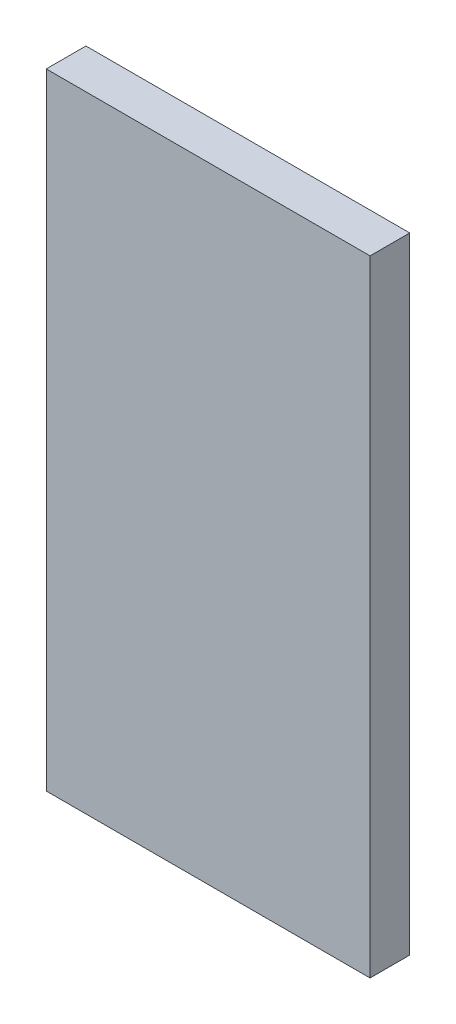
ISO-10303-21;
HEADER;
FILE_DESCRIPTION(('STEP AP214'),'2;1');
FILE_NAME('part.step','',(''),(''),'','','');
FILE_SCHEMA(('AUTOMOTIVE_DESIGN { 1 0 10303 214 1 1 1 1 }'));
ENDSEC;
DATA;
#1=APPLICATION_CONTEXT('core data for automotive mechanical design processes');
#2=APPLICATION_PROTOCOL_DEFINITION('international standard','automotive_design',2000,#1);
#3=PRODUCT_CONTEXT('',#1,'mechanical');
#4=PRODUCT('Part','Part','',(#3));
#5=PRODUCT_RELATED_PRODUCT_CATEGORY('part','',(#4));
#6=PRODUCT_DEFINITION_FORMATION('','',#4);
#7=PRODUCT_DEFINITION_CONTEXT('part definition',#1,'design');
#8=PRODUCT_DEFINITION('design','',#6,#7);
#9=PRODUCT_DEFINITION_SHAPE('','',#8);
#10=(LENGTH_UNIT() NAMED_UNIT(*) SI_UNIT(.MILLI.,.METRE.));
#11=(NAMED_UNIT(*) PLANE_ANGLE_UNIT() SI_UNIT($,.RADIAN.));
#12=(NAMED_UNIT(*) SI_UNIT($,.STERADIAN.) SOLID_ANGLE_UNIT());
#13=UNCERTAINTY_MEASURE_WITH_UNIT(LENGTH_MEASURE(1.E-05),#10,'distance_accuracy_value','');
#14=(GEOMETRIC_REPRESENTATION_CONTEXT(3) GLOBAL_UNCERTAINTY_ASSIGNED_CONTEXT((#13)) GLOBAL_UNIT_ASSIGNED_CONTEXT((#10,
#11,#12)) REPRESENTATION_CONTEXT('',''));
#15=CARTESIAN_POINT('',(0.,0.,0.));
#16=DIRECTION('',(0.,0.,1.));
#17=DIRECTION('',(1.,0.,0.));
#18=AXIS2_PLACEMENT_3D('',#15,#16,#17);
#19=CARTESIAN_POINT('',(4.672,-3.698,0.1));
#20=DIRECTION('',(0.,0.,1.));
#21=DIRECTION('',(1.,0.,0.));
#22=AXIS2_PLACEMENT_3D('',#19,#20,#21);
#23=PLANE('',#22);
#24=DIRECTION('',(0.,1.,0.));
#25=VECTOR('',#24,1.);
#26=CARTESIAN_POINT('',(5.488,-3.698,0.1));
#27=LINE('',#26,#25);
#28=CARTESIAN_POINT('',(5.488,-2.122,0.1));
#29=VERTEX_POINT('',#28);
#30=CARTESIAN_POINT('',(5.488,-3.698,0.1));
#31=VERTEX_POINT('',#30);
#32=EDGE_CURVE('E75',#29,#31,#27,.F.);
#33=ORIENTED_EDGE('',*,*,#32,.F.);
#34=DIRECTION('',(1.,0.,0.));
#35=VECTOR('',#34,1.);
#36=CARTESIAN_POINT('',(4.672,-2.122,0.1));
#37=LINE('',#36,#35);
#38=CARTESIAN_POINT('',(4.672,-2.122,0.1));
#39=VERTEX_POINT('',#38);
#40=EDGE_CURVE('E57',#39,#29,#37,.T.);
#41=ORIENTED_EDGE('',*,*,#40,.F.);
#42=DIRECTION('',(0.,1.,0.));
#43=VECTOR('',#42,1.);
#44=CARTESIAN_POINT('',(4.672,-3.698,0.1));
#45=LINE('',#44,#43);
#46=CARTESIAN_POINT('',(4.672,-3.698,0.1));
#47=VERTEX_POINT('',#46);
#48=EDGE_CURVE('E19',#39,#47,#45,.F.);
#49=ORIENTED_EDGE('',*,*,#48,.T.);
#50=DIRECTION('',(1.,0.,0.));
#51=VECTOR('',#50,1.);
#52=CARTESIAN_POINT('',(4.672,-3.698,0.1));
#53=LINE('',#52,#51);
#54=EDGE_CURVE('E54',#47,#31,#53,.T.);
#55=ORIENTED_EDGE('',*,*,#54,.T.);
#56=EDGE_LOOP('',(#33,#41,#49,#55));
#57=FACE_BOUND('',#56,.T.);
#58=ADVANCED_FACE('F16',(#57),#23,.T.);
#59=CARTESIAN_POINT('',(4.672,-3.698,0.));
#60=DIRECTION('',(1.,0.,0.));
#61=DIRECTION('',(0.,0.,-1.));
#62=AXIS2_PLACEMENT_3D('',#59,#60,#61);
#63=PLANE('',#62);
#64=DIRECTION('',(0.,0.,1.));
#65=VECTOR('',#64,1.);
#66=CARTESIAN_POINT('',(4.672,-2.122,0.));
#67=LINE('',#66,#65);
#68=CARTESIAN_POINT('',(4.672,-2.122,0.));
#69=VERTEX_POINT('',#68);
#70=EDGE_CURVE('E77',#69,#39,#67,.T.);
#71=ORIENTED_EDGE('',*,*,#70,.F.);
#72=DIRECTION('',(0.,1.,0.));
#73=VECTOR('',#72,1.);
#74=CARTESIAN_POINT('',(4.672,-3.698,0.));
#75=LINE('',#74,#73);
#76=CARTESIAN_POINT('',(4.672,-3.698,0.));
#77=VERTEX_POINT('',#76);
#78=EDGE_CURVE('E72',#69,#77,#75,.F.);
#79=ORIENTED_EDGE('',*,*,#78,.T.);
#80=DIRECTION('',(0.,0.,1.));
#81=VECTOR('',#80,1.);
#82=CARTESIAN_POINT('',(4.672,-3.698,0.));
#83=LINE('',#82,#81);
#84=EDGE_CURVE('E62',#77,#47,#83,.T.);
#85=ORIENTED_EDGE('',*,*,#84,.T.);
#86=ORIENTED_EDGE('',*,*,#48,.F.);
#87=EDGE_LOOP('',(#71,#79,#85,#86));
#88=FACE_BOUND('',#87,.T.);
#89=ADVANCED_FACE('F71',(#88),#63,.F.);
#90=CARTESIAN_POINT('',(4.672,-3.698,0.));
#91=DIRECTION('',(0.,1.,0.));
#92=DIRECTION('',(0.,0.,1.));
#93=AXIS2_PLACEMENT_3D('',#90,#91,#92);
#94=PLANE('',#93);
#95=ORIENTED_EDGE('',*,*,#54,.F.);
#96=ORIENTED_EDGE('',*,*,#84,.F.);
#97=DIRECTION('',(1.,0.,0.));
#98=VECTOR('',#97,1.);
#99=CARTESIAN_POINT('',(4.672,-3.698,0.));
#100=LINE('',#99,#98);
#101=CARTESIAN_POINT('',(5.488,-3.698,0.));
#102=VERTEX_POINT('',#101);
#103=EDGE_CURVE('E82',#77,#102,#100,.T.);
#104=ORIENTED_EDGE('',*,*,#103,.T.);
#105=DIRECTION('',(0.,0.,-1.));
#106=VECTOR('',#105,1.);
#107=CARTESIAN_POINT('',(5.488,-3.698,0.));
#108=LINE('',#107,#106);
#109=EDGE_CURVE('E68',#31,#102,#108,.T.);
#110=ORIENTED_EDGE('',*,*,#109,.F.);
#111=EDGE_LOOP('',(#95,#96,#104,#110));
#112=FACE_BOUND('',#111,.T.);
#113=ADVANCED_FACE('F65',(#112),#94,.F.);
#114=CARTESIAN_POINT('',(5.488,-3.698,0.));
#115=DIRECTION('',(1.,0.,0.));
#116=DIRECTION('',(0.,0.,-1.));
#117=AXIS2_PLACEMENT_3D('',#114,#115,#116);
#118=PLANE('',#117);
#119=DIRECTION('',(0.,0.,1.));
#120=VECTOR('',#119,1.);
#121=CARTESIAN_POINT('',(5.488,-2.122,0.));
#122=LINE('',#121,#120);
#123=CARTESIAN_POINT('',(5.488,-2.122,0.));
#124=VERTEX_POINT('',#123);
#125=EDGE_CURVE('E33',#29,#124,#122,.F.);
#126=ORIENTED_EDGE('',*,*,#125,.F.);
#127=ORIENTED_EDGE('',*,*,#32,.T.);
#128=ORIENTED_EDGE('',*,*,#109,.T.);
#129=DIRECTION('',(0.,1.,0.));
#130=VECTOR('',#129,1.);
#131=CARTESIAN_POINT('',(5.488,-3.698,0.));
#132=LINE('',#131,#130);
#133=EDGE_CURVE('E25',#102,#124,#132,.T.);
#134=ORIENTED_EDGE('',*,*,#133,.T.);
#135=EDGE_LOOP('',(#126,#127,#128,#134));
#136=FACE_BOUND('',#135,.T.);
#137=ADVANCED_FACE('F87',(#136),#118,.T.);
#138=CARTESIAN_POINT('',(4.672,-2.122,0.));
#139=DIRECTION('',(0.,1.,0.));
#140=DIRECTION('',(0.,0.,1.));
#141=AXIS2_PLACEMENT_3D('',#138,#139,#140);
#142=PLANE('',#141);
#143=ORIENTED_EDGE('',*,*,#40,.T.);
#144=ORIENTED_EDGE('',*,*,#125,.T.);
#145=DIRECTION('',(1.,0.,0.));
#146=VECTOR('',#145,1.);
#147=CARTESIAN_POINT('',(4.672,-2.122,0.));
#148=LINE('',#147,#146);
#149=EDGE_CURVE('E11',#124,#69,#148,.F.);
#150=ORIENTED_EDGE('',*,*,#149,.T.);
#151=ORIENTED_EDGE('',*,*,#70,.T.);
#152=EDGE_LOOP('',(#143,#144,#150,#151));
#153=FACE_BOUND('',#152,.T.);
#154=ADVANCED_FACE('F90',(#153),#142,.T.);
#155=CARTESIAN_POINT('',(4.672,-3.698,0.));
#156=DIRECTION('',(0.,0.,1.));
#157=DIRECTION('',(1.,0.,0.));
#158=AXIS2_PLACEMENT_3D('',#155,#156,#157);
#159=PLANE('',#158);
#160=ORIENTED_EDGE('',*,*,#133,.F.);
#161=ORIENTED_EDGE('',*,*,#103,.F.);
#162=ORIENTED_EDGE('',*,*,#78,.F.);
#163=ORIENTED_EDGE('',*,*,#149,.F.);
#164=EDGE_LOOP('',(#160,#161,#162,#163));
#165=FACE_BOUND('',#164,.T.);
#166=ADVANCED_FACE('F89',(#165),#159,.F.);
#167=CLOSED_SHELL('',(#58,#89,#113,#137,#154,#166));
#168=MANIFOLD_SOLID_BREP('B1',#167);
#169=ADVANCED_BREP_SHAPE_REPRESENTATION('',(#18,#168),#14);
#170=SHAPE_DEFINITION_REPRESENTATION(#9,#169);
ENDSEC;
END-ISO-10303-21;
